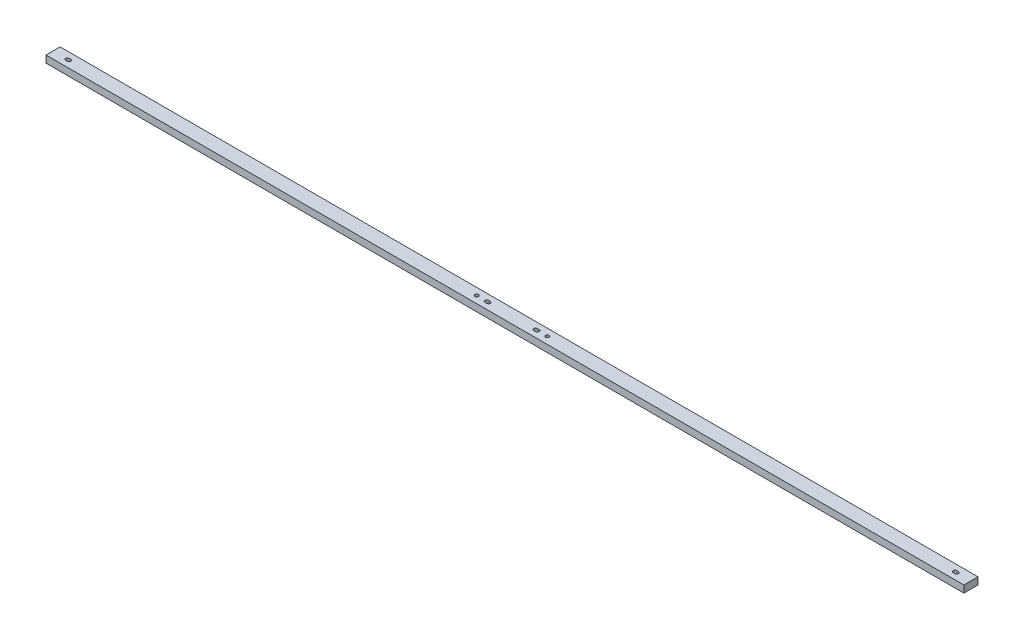
ISO-10303-21;
HEADER;
FILE_DESCRIPTION(('STEP AP214'),'2;1');
FILE_NAME('part.step','',(''),(''),'','','');
FILE_SCHEMA(('AUTOMOTIVE_DESIGN { 1 0 10303 214 1 1 1 1 }'));
ENDSEC;
DATA;
#1=APPLICATION_CONTEXT('core data for automotive mechanical design processes');
#2=APPLICATION_PROTOCOL_DEFINITION('international standard','automotive_design',2000,#1);
#3=PRODUCT_CONTEXT('',#1,'mechanical');
#4=PRODUCT('Part','Part','',(#3));
#5=PRODUCT_RELATED_PRODUCT_CATEGORY('part','',(#4));
#6=PRODUCT_DEFINITION_FORMATION('','',#4);
#7=PRODUCT_DEFINITION_CONTEXT('part definition',#1,'design');
#8=PRODUCT_DEFINITION('design','',#6,#7);
#9=PRODUCT_DEFINITION_SHAPE('','',#8);
#10=(LENGTH_UNIT() NAMED_UNIT(*) SI_UNIT(.MILLI.,.METRE.));
#11=(NAMED_UNIT(*) PLANE_ANGLE_UNIT() SI_UNIT($,.RADIAN.));
#12=(NAMED_UNIT(*) SI_UNIT($,.STERADIAN.) SOLID_ANGLE_UNIT());
#13=UNCERTAINTY_MEASURE_WITH_UNIT(LENGTH_MEASURE(1.E-05),#10,'distance_accuracy_value','');
#14=(GEOMETRIC_REPRESENTATION_CONTEXT(3) GLOBAL_UNCERTAINTY_ASSIGNED_CONTEXT((#13)) GLOBAL_UNIT_ASSIGNED_CONTEXT((#10,
#11,#12)) REPRESENTATION_CONTEXT('',''));
#15=CARTESIAN_POINT('',(0.,0.,0.));
#16=DIRECTION('',(0.,0.,1.));
#17=DIRECTION('',(1.,0.,0.));
#18=AXIS2_PLACEMENT_3D('',#15,#16,#17);
#19=CARTESIAN_POINT('',(0.,12.7,0.));
#20=DIRECTION('',(0.,1.,0.));
#21=DIRECTION('',(0.,0.,1.));
#22=AXIS2_PLACEMENT_3D('',#19,#20,#21);
#23=PLANE('',#22);
#24=CARTESIAN_POINT('',(63.5000000000007,12.7,0.));
#25=DIRECTION('',(0.,1.,0.));
#26=DIRECTION('',(0.,0.,1.));
#27=AXIS2_PLACEMENT_3D('',#24,#25,#26);
#28=CIRCLE('',#27,3.175);
#29=CARTESIAN_POINT('',(63.5000000000007,12.7,3.17500000000008));
#30=VERTEX_POINT('',#29);
#31=EDGE_CURVE('E209',#30,#30,#28,.T.);
#32=ORIENTED_EDGE('',*,*,#31,.F.);
#33=EDGE_LOOP('',(#32));
#34=FACE_BOUND('',#33,.T.);
#35=DIRECTION('',(0.,0.,-1.));
#36=VECTOR('',#35,1.);
#37=CARTESIAN_POINT('',(825.500000000001,12.7,-12.7));
#38=LINE('',#37,#36);
#39=CARTESIAN_POINT('',(825.500000000001,12.7,12.7));
#40=VERTEX_POINT('',#39);
#41=CARTESIAN_POINT('',(825.500000000001,12.7,-12.7));
#42=VERTEX_POINT('',#41);
#43=EDGE_CURVE('E312',#40,#42,#38,.T.);
#44=ORIENTED_EDGE('',*,*,#43,.T.);
#45=DIRECTION('',(-1.,0.,0.));
#46=VECTOR('',#45,1.);
#47=CARTESIAN_POINT('',(-825.499999999999,12.7,-12.7));
#48=LINE('',#47,#46);
#49=CARTESIAN_POINT('',(-825.499999999999,12.7,-12.7));
#50=VERTEX_POINT('',#49);
#51=EDGE_CURVE('E315',#42,#50,#48,.T.);
#52=ORIENTED_EDGE('',*,*,#51,.T.);
#53=DIRECTION('',(0.,0.,1.));
#54=VECTOR('',#53,1.);
#55=CARTESIAN_POINT('',(-825.499999999999,12.7,-12.7));
#56=LINE('',#55,#54);
#57=CARTESIAN_POINT('',(-825.499999999999,12.7,12.7));
#58=VERTEX_POINT('',#57);
#59=EDGE_CURVE('E318',#50,#58,#56,.T.);
#60=ORIENTED_EDGE('',*,*,#59,.T.);
#61=DIRECTION('',(1.,0.,0.));
#62=VECTOR('',#61,1.);
#63=CARTESIAN_POINT('',(-825.499999999999,12.7,12.7));
#64=LINE('',#63,#62);
#65=EDGE_CURVE('E320',#58,#40,#64,.T.);
#66=ORIENTED_EDGE('',*,*,#65,.T.);
#67=EDGE_LOOP('',(#44,#52,#60,#66));
#68=FACE_BOUND('',#67,.T.);
#69=DIRECTION('',(1.,0.,0.));
#70=VECTOR('',#69,1.);
#71=CARTESIAN_POINT('',(-799.655499999999,12.7,3.17500000000059));
#72=LINE('',#71,#70);
#73=CARTESIAN_POINT('',(-799.655499999999,12.7,3.17500000000059));
#74=VERTEX_POINT('',#73);
#75=CARTESIAN_POINT('',(-796.480499999999,12.7,3.17500000000039));
#76=VERTEX_POINT('',#75);
#77=EDGE_CURVE('E283',#74,#76,#72,.T.);
#78=ORIENTED_EDGE('',*,*,#77,.F.);
#79=CARTESIAN_POINT('',(-799.655499999999,12.7,0.));
#80=DIRECTION('',(0.,1.,0.));
#81=DIRECTION('',(0.,0.,1.));
#82=AXIS2_PLACEMENT_3D('',#79,#80,#81);
#83=CIRCLE('',#82,3.17500000000039);
#84=CARTESIAN_POINT('',(-799.655499999999,12.7,-3.1750000000002));
#85=VERTEX_POINT('',#84);
#86=EDGE_CURVE('E281',#85,#74,#83,.T.);
#87=ORIENTED_EDGE('',*,*,#86,.F.);
#88=DIRECTION('',(-1.,0.,0.));
#89=VECTOR('',#88,1.);
#90=CARTESIAN_POINT('',(-799.655499999999,12.7,-3.1750000000002));
#91=LINE('',#90,#89);
#92=CARTESIAN_POINT('',(-796.480499999999,12.7,-3.1750000000002));
#93=VERTEX_POINT('',#92);
#94=EDGE_CURVE('E289',#93,#85,#91,.T.);
#95=ORIENTED_EDGE('',*,*,#94,.F.);
#96=CARTESIAN_POINT('',(-796.480499999999,12.7,0.));
#97=DIRECTION('',(0.,1.,0.));
#98=DIRECTION('',(0.,0.,1.));
#99=AXIS2_PLACEMENT_3D('',#96,#97,#98);
#100=CIRCLE('',#99,3.17500000000039);
#101=EDGE_CURVE('E286',#76,#93,#100,.T.);
#102=ORIENTED_EDGE('',*,*,#101,.F.);
#103=EDGE_LOOP('',(#78,#87,#95,#102));
#104=FACE_BOUND('',#103,.T.);
#105=DIRECTION('',(-1.,0.,0.));
#106=VECTOR('',#105,1.);
#107=CARTESIAN_POINT('',(45.5295000000007,12.7,-3.17500000000001));
#108=LINE('',#107,#106);
#109=CARTESIAN_POINT('',(45.5295000000007,12.7,-3.17500000000001));
#110=VERTEX_POINT('',#109);
#111=CARTESIAN_POINT('',(42.3545000000007,12.7,-3.17500000000001));
#112=VERTEX_POINT('',#111);
#113=EDGE_CURVE('E252',#110,#112,#108,.T.);
#114=ORIENTED_EDGE('',*,*,#113,.F.);
#115=CARTESIAN_POINT('',(45.5295000000007,12.7,0.));
#116=DIRECTION('',(0.,1.,0.));
#117=DIRECTION('',(0.,0.,-1.));
#118=AXIS2_PLACEMENT_3D('',#115,#116,#117);
#119=CIRCLE('',#118,3.17500000000001);
#120=CARTESIAN_POINT('',(45.5295000000007,12.7,3.17500000000001));
#121=VERTEX_POINT('',#120);
#122=EDGE_CURVE('E250',#121,#110,#119,.T.);
#123=ORIENTED_EDGE('',*,*,#122,.F.);
#124=DIRECTION('',(1.,0.,0.));
#125=VECTOR('',#124,1.);
#126=CARTESIAN_POINT('',(45.5295000000007,12.7,3.17500000000001));
#127=LINE('',#126,#125);
#128=CARTESIAN_POINT('',(42.3545000000007,12.7,3.17500000000001));
#129=VERTEX_POINT('',#128);
#130=EDGE_CURVE('E258',#129,#121,#127,.T.);
#131=ORIENTED_EDGE('',*,*,#130,.F.);
#132=CARTESIAN_POINT('',(42.3545000000007,12.7,0.));
#133=DIRECTION('',(0.,1.,0.));
#134=DIRECTION('',(0.,0.,-1.));
#135=AXIS2_PLACEMENT_3D('',#132,#133,#134);
#136=CIRCLE('',#135,3.17500000000001);
#137=EDGE_CURVE('E255',#112,#129,#136,.T.);
#138=ORIENTED_EDGE('',*,*,#137,.F.);
#139=EDGE_LOOP('',(#114,#123,#131,#138));
#140=FACE_BOUND('',#139,.T.);
#141=DIRECTION('',(1.,0.,0.));
#142=VECTOR('',#141,1.);
#143=CARTESIAN_POINT('',(-45.5294999999993,12.7,3.17500000000002));
#144=LINE('',#143,#142);
#145=CARTESIAN_POINT('',(-45.5294999999993,12.7,3.17500000000002));
#146=VERTEX_POINT('',#145);
#147=CARTESIAN_POINT('',(-42.3544999999994,12.7,3.17500000000001));
#148=VERTEX_POINT('',#147);
#149=EDGE_CURVE('E221',#146,#148,#144,.T.);
#150=ORIENTED_EDGE('',*,*,#149,.F.);
#151=CARTESIAN_POINT('',(-45.5294999999993,12.7,0.));
#152=DIRECTION('',(0.,1.,0.));
#153=DIRECTION('',(0.,0.,1.));
#154=AXIS2_PLACEMENT_3D('',#151,#152,#153);
#155=CIRCLE('',#154,3.17500000000001);
#156=CARTESIAN_POINT('',(-45.5294999999993,12.7,-3.175));
#157=VERTEX_POINT('',#156);
#158=EDGE_CURVE('E219',#157,#146,#155,.T.);
#159=ORIENTED_EDGE('',*,*,#158,.F.);
#160=DIRECTION('',(-1.,0.,0.));
#161=VECTOR('',#160,1.);
#162=CARTESIAN_POINT('',(-45.5294999999993,12.7,-3.175));
#163=LINE('',#162,#161);
#164=CARTESIAN_POINT('',(-42.3544999999994,12.7,-3.175));
#165=VERTEX_POINT('',#164);
#166=EDGE_CURVE('E227',#165,#157,#163,.T.);
#167=ORIENTED_EDGE('',*,*,#166,.F.);
#168=CARTESIAN_POINT('',(-42.3544999999994,12.7,0.));
#169=DIRECTION('',(0.,1.,0.));
#170=DIRECTION('',(0.,0.,1.));
#171=AXIS2_PLACEMENT_3D('',#168,#169,#170);
#172=CIRCLE('',#171,3.17500000000001);
#173=EDGE_CURVE('E224',#148,#165,#172,.T.);
#174=ORIENTED_EDGE('',*,*,#173,.F.);
#175=EDGE_LOOP('',(#150,#159,#167,#174));
#176=FACE_BOUND('',#175,.T.);
#177=DIRECTION('',(-1.,0.,0.));
#178=VECTOR('',#177,1.);
#179=CARTESIAN_POINT('',(799.655500000001,12.7,-3.17500000000039));
#180=LINE('',#179,#178);
#181=CARTESIAN_POINT('',(799.655500000001,12.7,-3.17500000000039));
#182=VERTEX_POINT('',#181);
#183=CARTESIAN_POINT('',(796.480500000001,12.7,-3.17500000000039));
#184=VERTEX_POINT('',#183);
#185=EDGE_CURVE('E188',#182,#184,#180,.T.);
#186=ORIENTED_EDGE('',*,*,#185,.F.);
#187=CARTESIAN_POINT('',(799.655500000001,12.7,-1.95859109699115E-13));
#188=DIRECTION('',(0.,1.,0.));
#189=DIRECTION('',(0.,0.,-1.));
#190=AXIS2_PLACEMENT_3D('',#187,#188,#189);
#191=CIRCLE('',#190,3.17500000000039);
#192=CARTESIAN_POINT('',(799.655500000001,12.7,3.17500000000039));
#193=VERTEX_POINT('',#192);
#194=EDGE_CURVE('E180',#193,#182,#191,.T.);
#195=ORIENTED_EDGE('',*,*,#194,.F.);
#196=DIRECTION('',(1.,0.,0.));
#197=VECTOR('',#196,1.);
#198=CARTESIAN_POINT('',(799.655500000001,12.7,3.17500000000039));
#199=LINE('',#198,#197);
#200=CARTESIAN_POINT('',(796.480500000001,12.7,3.17500000000039));
#201=VERTEX_POINT('',#200);
#202=EDGE_CURVE('E203',#201,#193,#199,.T.);
#203=ORIENTED_EDGE('',*,*,#202,.F.);
#204=CARTESIAN_POINT('',(796.480500000001,12.7,-1.95664697019751E-13));
#205=DIRECTION('',(0.,1.,0.));
#206=DIRECTION('',(0.,0.,-1.));
#207=AXIS2_PLACEMENT_3D('',#204,#205,#206);
#208=CIRCLE('',#207,3.17500000000039);
#209=EDGE_CURVE('E201',#184,#201,#208,.T.);
#210=ORIENTED_EDGE('',*,*,#209,.F.);
#211=EDGE_LOOP('',(#186,#195,#203,#210));
#212=FACE_BOUND('',#211,.T.);
#213=CARTESIAN_POINT('',(-63.4999999999996,12.7,0.));
#214=DIRECTION('',(0.,1.,0.));
#215=DIRECTION('',(0.,0.,-1.));
#216=AXIS2_PLACEMENT_3D('',#213,#214,#215);
#217=CIRCLE('',#216,3.175);
#218=CARTESIAN_POINT('',(-63.4999999999996,12.7,-3.17499999999991));
#219=VERTEX_POINT('',#218);
#220=EDGE_CURVE('E562',#219,#219,#217,.T.);
#221=ORIENTED_EDGE('',*,*,#220,.F.);
#222=EDGE_LOOP('',(#221));
#223=FACE_BOUND('',#222,.T.);
#224=ADVANCED_FACE('F43',(#34,#68,#104,#140,#176,#212,#223),#23,.T.);
#225=CARTESIAN_POINT('',(0.,0.,0.));
#226=DIRECTION('',(0.,1.,0.));
#227=DIRECTION('',(0.,0.,1.));
#228=AXIS2_PLACEMENT_3D('',#225,#226,#227);
#229=PLANE('',#228);
#230=CARTESIAN_POINT('',(-45.5294999999993,0.,0.));
#231=DIRECTION('',(0.,1.,0.));
#232=DIRECTION('',(0.,0.,1.));
#233=AXIS2_PLACEMENT_3D('',#230,#231,#232);
#234=CIRCLE('',#233,3.17500000000001);
#235=CARTESIAN_POINT('',(-45.5294999999993,0.,-3.175));
#236=VERTEX_POINT('',#235);
#237=CARTESIAN_POINT('',(-45.5294999999993,0.,3.17500000000002));
#238=VERTEX_POINT('',#237);
#239=EDGE_CURVE('E196',#236,#238,#234,.T.);
#240=ORIENTED_EDGE('',*,*,#239,.T.);
#241=DIRECTION('',(1.,0.,0.));
#242=VECTOR('',#241,1.);
#243=CARTESIAN_POINT('',(-45.5294999999993,0.,3.17500000000002));
#244=LINE('',#243,#242);
#245=CARTESIAN_POINT('',(-42.3544999999994,0.,3.17500000000001));
#246=VERTEX_POINT('',#245);
#247=EDGE_CURVE('E232',#238,#246,#244,.T.);
#248=ORIENTED_EDGE('',*,*,#247,.T.);
#249=CARTESIAN_POINT('',(-42.3544999999994,0.,0.));
#250=DIRECTION('',(0.,1.,0.));
#251=DIRECTION('',(0.,0.,1.));
#252=AXIS2_PLACEMENT_3D('',#249,#250,#251);
#253=CIRCLE('',#252,3.17500000000001);
#254=CARTESIAN_POINT('',(-42.3544999999994,0.,-3.175));
#255=VERTEX_POINT('',#254);
#256=EDGE_CURVE('E235',#246,#255,#253,.T.);
#257=ORIENTED_EDGE('',*,*,#256,.T.);
#258=DIRECTION('',(-1.,0.,0.));
#259=VECTOR('',#258,1.);
#260=CARTESIAN_POINT('',(-45.5294999999993,0.,-3.175));
#261=LINE('',#260,#259);
#262=EDGE_CURVE('E222',#255,#236,#261,.T.);
#263=ORIENTED_EDGE('',*,*,#262,.T.);
#264=EDGE_LOOP('',(#240,#248,#257,#263));
#265=FACE_BOUND('',#264,.T.);
#266=CARTESIAN_POINT('',(-799.655499999999,0.,0.));
#267=DIRECTION('',(0.,1.,0.));
#268=DIRECTION('',(0.,0.,1.));
#269=AXIS2_PLACEMENT_3D('',#266,#267,#268);
#270=CIRCLE('',#269,3.17500000000039);
#271=CARTESIAN_POINT('',(-799.655499999999,0.,-3.1750000000002));
#272=VERTEX_POINT('',#271);
#273=CARTESIAN_POINT('',(-799.655499999999,0.,3.17500000000059));
#274=VERTEX_POINT('',#273);
#275=EDGE_CURVE('E280',#272,#274,#270,.T.);
#276=ORIENTED_EDGE('',*,*,#275,.T.);
#277=DIRECTION('',(1.,0.,0.));
#278=VECTOR('',#277,1.);
#279=CARTESIAN_POINT('',(-799.655499999999,0.,3.17500000000059));
#280=LINE('',#279,#278);
#281=CARTESIAN_POINT('',(-796.480499999999,0.,3.17500000000039));
#282=VERTEX_POINT('',#281);
#283=EDGE_CURVE('E294',#274,#282,#280,.T.);
#284=ORIENTED_EDGE('',*,*,#283,.T.);
#285=CARTESIAN_POINT('',(-796.480499999999,0.,0.));
#286=DIRECTION('',(0.,1.,0.));
#287=DIRECTION('',(0.,0.,1.));
#288=AXIS2_PLACEMENT_3D('',#285,#286,#287);
#289=CIRCLE('',#288,3.17500000000039);
#290=CARTESIAN_POINT('',(-796.480499999999,0.,-3.1750000000002));
#291=VERTEX_POINT('',#290);
#292=EDGE_CURVE('E297',#282,#291,#289,.T.);
#293=ORIENTED_EDGE('',*,*,#292,.T.);
#294=DIRECTION('',(-1.,0.,0.));
#295=VECTOR('',#294,1.);
#296=CARTESIAN_POINT('',(-799.655499999999,0.,-3.1750000000002));
#297=LINE('',#296,#295);
#298=EDGE_CURVE('E284',#291,#272,#297,.T.);
#299=ORIENTED_EDGE('',*,*,#298,.T.);
#300=EDGE_LOOP('',(#276,#284,#293,#299));
#301=FACE_BOUND('',#300,.T.);
#302=DIRECTION('',(0.,0.,-1.));
#303=VECTOR('',#302,1.);
#304=CARTESIAN_POINT('',(825.500000000001,0.,-12.7));
#305=LINE('',#304,#303);
#306=CARTESIAN_POINT('',(825.500000000001,0.,12.7));
#307=VERTEX_POINT('',#306);
#308=CARTESIAN_POINT('',(825.500000000001,0.,-12.7));
#309=VERTEX_POINT('',#308);
#310=EDGE_CURVE('E311',#307,#309,#305,.T.);
#311=ORIENTED_EDGE('',*,*,#310,.F.);
#312=DIRECTION('',(1.,0.,0.));
#313=VECTOR('',#312,1.);
#314=CARTESIAN_POINT('',(-825.499999999999,0.,12.7));
#315=LINE('',#314,#313);
#316=CARTESIAN_POINT('',(-825.499999999999,0.,12.7));
#317=VERTEX_POINT('',#316);
#318=EDGE_CURVE('E316',#317,#307,#315,.T.);
#319=ORIENTED_EDGE('',*,*,#318,.F.);
#320=DIRECTION('',(0.,0.,1.));
#321=VECTOR('',#320,1.);
#322=CARTESIAN_POINT('',(-825.499999999999,0.,-12.7));
#323=LINE('',#322,#321);
#324=CARTESIAN_POINT('',(-825.499999999999,0.,-12.7));
#325=VERTEX_POINT('',#324);
#326=EDGE_CURVE('E327',#325,#317,#323,.T.);
#327=ORIENTED_EDGE('',*,*,#326,.F.);
#328=DIRECTION('',(-1.,0.,0.));
#329=VECTOR('',#328,1.);
#330=CARTESIAN_POINT('',(-825.499999999999,0.,-12.7));
#331=LINE('',#330,#329);
#332=EDGE_CURVE('E325',#309,#325,#331,.T.);
#333=ORIENTED_EDGE('',*,*,#332,.F.);
#334=EDGE_LOOP('',(#311,#319,#327,#333));
#335=FACE_BOUND('',#334,.T.);
#336=CARTESIAN_POINT('',(45.5295000000007,0.,0.));
#337=DIRECTION('',(0.,1.,0.));
#338=DIRECTION('',(0.,0.,-1.));
#339=AXIS2_PLACEMENT_3D('',#336,#337,#338);
#340=CIRCLE('',#339,3.17500000000001);
#341=CARTESIAN_POINT('',(45.5295000000007,0.,3.17500000000001));
#342=VERTEX_POINT('',#341);
#343=CARTESIAN_POINT('',(45.5295000000007,0.,-3.17500000000001));
#344=VERTEX_POINT('',#343);
#345=EDGE_CURVE('E249',#342,#344,#340,.T.);
#346=ORIENTED_EDGE('',*,*,#345,.T.);
#347=DIRECTION('',(-1.,0.,0.));
#348=VECTOR('',#347,1.);
#349=CARTESIAN_POINT('',(45.5295000000007,0.,-3.17500000000001));
#350=LINE('',#349,#348);
#351=CARTESIAN_POINT('',(42.3545000000007,0.,-3.17500000000001));
#352=VERTEX_POINT('',#351);
#353=EDGE_CURVE('E263',#344,#352,#350,.T.);
#354=ORIENTED_EDGE('',*,*,#353,.T.);
#355=CARTESIAN_POINT('',(42.3545000000007,0.,0.));
#356=DIRECTION('',(0.,1.,0.));
#357=DIRECTION('',(0.,0.,-1.));
#358=AXIS2_PLACEMENT_3D('',#355,#356,#357);
#359=CIRCLE('',#358,3.17500000000001);
#360=CARTESIAN_POINT('',(42.3545000000007,0.,3.175));
#361=VERTEX_POINT('',#360);
#362=EDGE_CURVE('E266',#352,#361,#359,.T.);
#363=ORIENTED_EDGE('',*,*,#362,.T.);
#364=DIRECTION('',(1.,0.,0.));
#365=VECTOR('',#364,1.);
#366=CARTESIAN_POINT('',(45.5295000000007,0.,3.17500000000001));
#367=LINE('',#366,#365);
#368=EDGE_CURVE('E253',#361,#342,#367,.T.);
#369=ORIENTED_EDGE('',*,*,#368,.T.);
#370=EDGE_LOOP('',(#346,#354,#363,#369));
#371=FACE_BOUND('',#370,.T.);
#372=CARTESIAN_POINT('',(799.655500000001,0.,-1.95859109699115E-13));
#373=DIRECTION('',(0.,1.,0.));
#374=DIRECTION('',(0.,0.,-1.));
#375=AXIS2_PLACEMENT_3D('',#372,#373,#374);
#376=CIRCLE('',#375,3.17500000000039);
#377=CARTESIAN_POINT('',(799.655500000001,0.,3.17500000000039));
#378=VERTEX_POINT('',#377);
#379=CARTESIAN_POINT('',(799.655500000001,0.,-3.17500000000039));
#380=VERTEX_POINT('',#379);
#381=EDGE_CURVE('E66',#378,#380,#376,.T.);
#382=ORIENTED_EDGE('',*,*,#381,.T.);
#383=DIRECTION('',(-1.,0.,0.));
#384=VECTOR('',#383,1.);
#385=CARTESIAN_POINT('',(799.655500000001,0.,-3.17500000000039));
#386=LINE('',#385,#384);
#387=CARTESIAN_POINT('',(796.480500000001,0.,-3.17500000000039));
#388=VERTEX_POINT('',#387);
#389=EDGE_CURVE('E195',#380,#388,#386,.T.);
#390=ORIENTED_EDGE('',*,*,#389,.T.);
#391=CARTESIAN_POINT('',(796.480500000001,0.,-1.95664697019751E-13));
#392=DIRECTION('',(0.,1.,0.));
#393=DIRECTION('',(0.,0.,-1.));
#394=AXIS2_PLACEMENT_3D('',#391,#392,#393);
#395=CIRCLE('',#394,3.17500000000039);
#396=CARTESIAN_POINT('',(796.480500000001,0.,3.1750000000002));
#397=VERTEX_POINT('',#396);
#398=EDGE_CURVE('E211',#388,#397,#395,.T.);
#399=ORIENTED_EDGE('',*,*,#398,.T.);
#400=DIRECTION('',(1.,0.,0.));
#401=VECTOR('',#400,1.);
#402=CARTESIAN_POINT('',(799.655500000001,0.,3.17500000000039));
#403=LINE('',#402,#401);
#404=EDGE_CURVE('E189',#397,#378,#403,.T.);
#405=ORIENTED_EDGE('',*,*,#404,.T.);
#406=EDGE_LOOP('',(#382,#390,#399,#405));
#407=FACE_BOUND('',#406,.T.);
#408=CARTESIAN_POINT('',(63.5000000000007,0.,0.));
#409=DIRECTION('',(0.,1.,0.));
#410=DIRECTION('',(0.,0.,1.));
#411=AXIS2_PLACEMENT_3D('',#408,#409,#410);
#412=CIRCLE('',#411,3.175);
#413=CARTESIAN_POINT('',(63.5000000000007,0.,3.17500000000008));
#414=VERTEX_POINT('',#413);
#415=EDGE_CURVE('E568',#414,#414,#412,.T.);
#416=ORIENTED_EDGE('',*,*,#415,.T.);
#417=EDGE_LOOP('',(#416));
#418=FACE_BOUND('',#417,.T.);
#419=CARTESIAN_POINT('',(-63.4999999999996,0.,0.));
#420=DIRECTION('',(0.,1.,0.));
#421=DIRECTION('',(0.,0.,-1.));
#422=AXIS2_PLACEMENT_3D('',#419,#420,#421);
#423=CIRCLE('',#422,3.175);
#424=CARTESIAN_POINT('',(-63.4999999999996,0.,-3.17499999999991));
#425=VERTEX_POINT('',#424);
#426=EDGE_CURVE('E565',#425,#425,#423,.T.);
#427=ORIENTED_EDGE('',*,*,#426,.T.);
#428=EDGE_LOOP('',(#427));
#429=FACE_BOUND('',#428,.T.);
#430=ADVANCED_FACE('F345',(#265,#301,#335,#371,#407,#418,#429),#229,.F.);
#431=CARTESIAN_POINT('',(825.500000000001,12.7,-12.7));
#432=DIRECTION('',(-1.,0.,0.));
#433=DIRECTION('',(0.,0.,1.));
#434=AXIS2_PLACEMENT_3D('',#431,#432,#433);
#435=PLANE('',#434);
#436=ORIENTED_EDGE('',*,*,#310,.T.);
#437=DIRECTION('',(0.,-1.,0.));
#438=VECTOR('',#437,1.);
#439=CARTESIAN_POINT('',(825.500000000001,12.7,-12.7));
#440=LINE('',#439,#438);
#441=EDGE_CURVE('E11',#42,#309,#440,.T.);
#442=ORIENTED_EDGE('',*,*,#441,.F.);
#443=ORIENTED_EDGE('',*,*,#43,.F.);
#444=DIRECTION('',(0.,-1.,0.));
#445=VECTOR('',#444,1.);
#446=CARTESIAN_POINT('',(825.500000000001,12.7,12.7));
#447=LINE('',#446,#445);
#448=EDGE_CURVE('E322',#40,#307,#447,.T.);
#449=ORIENTED_EDGE('',*,*,#448,.T.);
#450=EDGE_LOOP('',(#436,#442,#443,#449));
#451=FACE_BOUND('',#450,.T.);
#452=ADVANCED_FACE('F45',(#451),#435,.F.);
#453=CARTESIAN_POINT('',(-825.499999999999,12.7,-12.7));
#454=DIRECTION('',(0.,0.,1.));
#455=DIRECTION('',(1.,0.,0.));
#456=AXIS2_PLACEMENT_3D('',#453,#454,#455);
#457=PLANE('',#456);
#458=ORIENTED_EDGE('',*,*,#332,.T.);
#459=DIRECTION('',(0.,-1.,0.));
#460=VECTOR('',#459,1.);
#461=CARTESIAN_POINT('',(-825.499999999999,12.7,-12.7));
#462=LINE('',#461,#460);
#463=EDGE_CURVE('E51',#50,#325,#462,.T.);
#464=ORIENTED_EDGE('',*,*,#463,.F.);
#465=ORIENTED_EDGE('',*,*,#51,.F.);
#466=ORIENTED_EDGE('',*,*,#441,.T.);
#467=EDGE_LOOP('',(#458,#464,#465,#466));
#468=FACE_BOUND('',#467,.T.);
#469=ADVANCED_FACE('F356',(#468),#457,.F.);
#470=CARTESIAN_POINT('',(-825.499999999999,12.7,-12.7));
#471=DIRECTION('',(1.,0.,0.));
#472=DIRECTION('',(0.,0.,-1.));
#473=AXIS2_PLACEMENT_3D('',#470,#471,#472);
#474=PLANE('',#473);
#475=ORIENTED_EDGE('',*,*,#326,.T.);
#476=DIRECTION('',(0.,-1.,0.));
#477=VECTOR('',#476,1.);
#478=CARTESIAN_POINT('',(-825.499999999999,12.7,12.7));
#479=LINE('',#478,#477);
#480=EDGE_CURVE('E332',#58,#317,#479,.T.);
#481=ORIENTED_EDGE('',*,*,#480,.F.);
#482=ORIENTED_EDGE('',*,*,#59,.F.);
#483=ORIENTED_EDGE('',*,*,#463,.T.);
#484=EDGE_LOOP('',(#475,#481,#482,#483));
#485=FACE_BOUND('',#484,.T.);
#486=ADVANCED_FACE('F339',(#485),#474,.F.);
#487=CARTESIAN_POINT('',(-825.499999999999,12.7,12.7));
#488=DIRECTION('',(0.,0.,-1.));
#489=DIRECTION('',(-1.,0.,0.));
#490=AXIS2_PLACEMENT_3D('',#487,#488,#489);
#491=PLANE('',#490);
#492=ORIENTED_EDGE('',*,*,#318,.T.);
#493=ORIENTED_EDGE('',*,*,#448,.F.);
#494=ORIENTED_EDGE('',*,*,#65,.F.);
#495=ORIENTED_EDGE('',*,*,#480,.T.);
#496=EDGE_LOOP('',(#492,#493,#494,#495));
#497=FACE_BOUND('',#496,.T.);
#498=ADVANCED_FACE('F349',(#497),#491,.F.);
#499=CARTESIAN_POINT('',(-799.655499999999,12.7,0.));
#500=DIRECTION('',(0.,-1.,0.));
#501=DIRECTION('',(0.,0.,-1.));
#502=AXIS2_PLACEMENT_3D('',#499,#500,#501);
#503=CYLINDRICAL_SURFACE('',#502,3.17500000000039);
#504=ORIENTED_EDGE('',*,*,#275,.F.);
#505=DIRECTION('',(0.,-1.,0.));
#506=VECTOR('',#505,1.);
#507=CARTESIAN_POINT('',(-799.655499999999,12.7,-3.1750000000002));
#508=LINE('',#507,#506);
#509=EDGE_CURVE('E291',#85,#272,#508,.T.);
#510=ORIENTED_EDGE('',*,*,#509,.F.);
#511=ORIENTED_EDGE('',*,*,#86,.T.);
#512=DIRECTION('',(0.,-1.,0.));
#513=VECTOR('',#512,1.);
#514=CARTESIAN_POINT('',(-799.655499999999,12.7,3.17500000000059));
#515=LINE('',#514,#513);
#516=EDGE_CURVE('E308',#74,#274,#515,.T.);
#517=ORIENTED_EDGE('',*,*,#516,.T.);
#518=EDGE_LOOP('',(#504,#510,#511,#517));
#519=FACE_BOUND('',#518,.T.);
#520=ADVANCED_FACE('F373',(#519),#503,.F.);
#521=CARTESIAN_POINT('',(-799.655499999999,12.7,3.17500000000059));
#522=DIRECTION('',(0.,0.,-1.));
#523=DIRECTION('',(-1.,0.,0.));
#524=AXIS2_PLACEMENT_3D('',#521,#522,#523);
#525=PLANE('',#524);
#526=ORIENTED_EDGE('',*,*,#283,.F.);
#527=ORIENTED_EDGE('',*,*,#516,.F.);
#528=ORIENTED_EDGE('',*,*,#77,.T.);
#529=DIRECTION('',(0.,-1.,0.));
#530=VECTOR('',#529,1.);
#531=CARTESIAN_POINT('',(-796.480499999999,12.7,3.17500000000039));
#532=LINE('',#531,#530);
#533=EDGE_CURVE('E306',#76,#282,#532,.T.);
#534=ORIENTED_EDGE('',*,*,#533,.T.);
#535=EDGE_LOOP('',(#526,#527,#528,#534));
#536=FACE_BOUND('',#535,.T.);
#537=ADVANCED_FACE('F380',(#536),#525,.T.);
#538=CARTESIAN_POINT('',(-796.480499999999,12.7,0.));
#539=DIRECTION('',(0.,-1.,0.));
#540=DIRECTION('',(0.,0.,-1.));
#541=AXIS2_PLACEMENT_3D('',#538,#539,#540);
#542=CYLINDRICAL_SURFACE('',#541,3.17500000000039);
#543=ORIENTED_EDGE('',*,*,#292,.F.);
#544=ORIENTED_EDGE('',*,*,#533,.F.);
#545=ORIENTED_EDGE('',*,*,#101,.T.);
#546=DIRECTION('',(0.,-1.,0.));
#547=VECTOR('',#546,1.);
#548=CARTESIAN_POINT('',(-796.480499999999,12.7,-3.1750000000002));
#549=LINE('',#548,#547);
#550=EDGE_CURVE('E304',#93,#291,#549,.T.);
#551=ORIENTED_EDGE('',*,*,#550,.T.);
#552=EDGE_LOOP('',(#543,#544,#545,#551));
#553=FACE_BOUND('',#552,.T.);
#554=ADVANCED_FACE('F385',(#553),#542,.F.);
#555=CARTESIAN_POINT('',(-799.655499999999,12.7,-3.1750000000002));
#556=DIRECTION('',(0.,0.,1.));
#557=DIRECTION('',(1.,0.,0.));
#558=AXIS2_PLACEMENT_3D('',#555,#556,#557);
#559=PLANE('',#558);
#560=ORIENTED_EDGE('',*,*,#298,.F.);
#561=ORIENTED_EDGE('',*,*,#550,.F.);
#562=ORIENTED_EDGE('',*,*,#94,.T.);
#563=ORIENTED_EDGE('',*,*,#509,.T.);
#564=EDGE_LOOP('',(#560,#561,#562,#563));
#565=FACE_BOUND('',#564,.T.);
#566=ADVANCED_FACE('F393',(#565),#559,.T.);
#567=CARTESIAN_POINT('',(45.5295000000007,12.7,0.));
#568=DIRECTION('',(0.,-1.,0.));
#569=DIRECTION('',(0.,0.,-1.));
#570=AXIS2_PLACEMENT_3D('',#567,#568,#569);
#571=CYLINDRICAL_SURFACE('',#570,3.17500000000001);
#572=ORIENTED_EDGE('',*,*,#345,.F.);
#573=DIRECTION('',(0.,-1.,0.));
#574=VECTOR('',#573,1.);
#575=CARTESIAN_POINT('',(45.5295000000007,12.7,3.17500000000001));
#576=LINE('',#575,#574);
#577=EDGE_CURVE('E260',#121,#342,#576,.T.);
#578=ORIENTED_EDGE('',*,*,#577,.F.);
#579=ORIENTED_EDGE('',*,*,#122,.T.);
#580=DIRECTION('',(0.,-1.,0.));
#581=VECTOR('',#580,1.);
#582=CARTESIAN_POINT('',(45.5295000000007,12.7,-3.17500000000001));
#583=LINE('',#582,#581);
#584=EDGE_CURVE('E277',#110,#344,#583,.T.);
#585=ORIENTED_EDGE('',*,*,#584,.T.);
#586=EDGE_LOOP('',(#572,#578,#579,#585));
#587=FACE_BOUND('',#586,.T.);
#588=ADVANCED_FACE('F447',(#587),#571,.F.);
#589=CARTESIAN_POINT('',(45.5295000000007,12.7,-3.17500000000001));
#590=DIRECTION('',(0.,0.,1.));
#591=DIRECTION('',(1.,0.,0.));
#592=AXIS2_PLACEMENT_3D('',#589,#590,#591);
#593=PLANE('',#592);
#594=ORIENTED_EDGE('',*,*,#353,.F.);
#595=ORIENTED_EDGE('',*,*,#584,.F.);
#596=ORIENTED_EDGE('',*,*,#113,.T.);
#597=DIRECTION('',(0.,-1.,0.));
#598=VECTOR('',#597,1.);
#599=CARTESIAN_POINT('',(42.3545000000007,12.7,-3.17500000000001));
#600=LINE('',#599,#598);
#601=EDGE_CURVE('E275',#112,#352,#600,.T.);
#602=ORIENTED_EDGE('',*,*,#601,.T.);
#603=EDGE_LOOP('',(#594,#595,#596,#602));
#604=FACE_BOUND('',#603,.T.);
#605=ADVANCED_FACE('F443',(#604),#593,.T.);
#606=CARTESIAN_POINT('',(42.3545000000007,12.7,0.));
#607=DIRECTION('',(0.,-1.,0.));
#608=DIRECTION('',(0.,0.,-1.));
#609=AXIS2_PLACEMENT_3D('',#606,#607,#608);
#610=CYLINDRICAL_SURFACE('',#609,3.17500000000001);
#611=ORIENTED_EDGE('',*,*,#362,.F.);
#612=ORIENTED_EDGE('',*,*,#601,.F.);
#613=ORIENTED_EDGE('',*,*,#137,.T.);
#614=DIRECTION('',(0.,-1.,0.));
#615=VECTOR('',#614,1.);
#616=CARTESIAN_POINT('',(42.3545000000007,12.7,3.175));
#617=LINE('',#616,#615);
#618=EDGE_CURVE('E273',#129,#361,#617,.T.);
#619=ORIENTED_EDGE('',*,*,#618,.T.);
#620=EDGE_LOOP('',(#611,#612,#613,#619));
#621=FACE_BOUND('',#620,.T.);
#622=ADVANCED_FACE('F439',(#621),#610,.F.);
#623=CARTESIAN_POINT('',(45.5295000000007,12.7,3.17500000000001));
#624=DIRECTION('',(0.,0.,-1.));
#625=DIRECTION('',(-1.,0.,0.));
#626=AXIS2_PLACEMENT_3D('',#623,#624,#625);
#627=PLANE('',#626);
#628=ORIENTED_EDGE('',*,*,#368,.F.);
#629=ORIENTED_EDGE('',*,*,#618,.F.);
#630=ORIENTED_EDGE('',*,*,#130,.T.);
#631=ORIENTED_EDGE('',*,*,#577,.T.);
#632=EDGE_LOOP('',(#628,#629,#630,#631));
#633=FACE_BOUND('',#632,.T.);
#634=ADVANCED_FACE('F436',(#633),#627,.T.);
#635=CARTESIAN_POINT('',(-45.5294999999993,12.7,0.));
#636=DIRECTION('',(0.,-1.,0.));
#637=DIRECTION('',(0.,0.,-1.));
#638=AXIS2_PLACEMENT_3D('',#635,#636,#637);
#639=CYLINDRICAL_SURFACE('',#638,3.17500000000001);
#640=ORIENTED_EDGE('',*,*,#239,.F.);
#641=DIRECTION('',(0.,-1.,0.));
#642=VECTOR('',#641,1.);
#643=CARTESIAN_POINT('',(-45.5294999999993,12.7,-3.175));
#644=LINE('',#643,#642);
#645=EDGE_CURVE('E229',#157,#236,#644,.T.);
#646=ORIENTED_EDGE('',*,*,#645,.F.);
#647=ORIENTED_EDGE('',*,*,#158,.T.);
#648=DIRECTION('',(0.,-1.,0.));
#649=VECTOR('',#648,1.);
#650=CARTESIAN_POINT('',(-45.5294999999993,12.7,3.17500000000002));
#651=LINE('',#650,#649);
#652=EDGE_CURVE('E246',#146,#238,#651,.T.);
#653=ORIENTED_EDGE('',*,*,#652,.T.);
#654=EDGE_LOOP('',(#640,#646,#647,#653));
#655=FACE_BOUND('',#654,.T.);
#656=ADVANCED_FACE('F418',(#655),#639,.F.);
#657=CARTESIAN_POINT('',(-45.5294999999993,12.7,3.17500000000002));
#658=DIRECTION('',(0.,0.,-1.));
#659=DIRECTION('',(-1.,0.,0.));
#660=AXIS2_PLACEMENT_3D('',#657,#658,#659);
#661=PLANE('',#660);
#662=ORIENTED_EDGE('',*,*,#247,.F.);
#663=ORIENTED_EDGE('',*,*,#652,.F.);
#664=ORIENTED_EDGE('',*,*,#149,.T.);
#665=DIRECTION('',(0.,-1.,0.));
#666=VECTOR('',#665,1.);
#667=CARTESIAN_POINT('',(-42.3544999999994,12.7,3.17500000000001));
#668=LINE('',#667,#666);
#669=EDGE_CURVE('E244',#148,#246,#668,.T.);
#670=ORIENTED_EDGE('',*,*,#669,.T.);
#671=EDGE_LOOP('',(#662,#663,#664,#670));
#672=FACE_BOUND('',#671,.T.);
#673=ADVANCED_FACE('F412',(#672),#661,.T.);
#674=CARTESIAN_POINT('',(-42.3544999999994,12.7,0.));
#675=DIRECTION('',(0.,-1.,0.));
#676=DIRECTION('',(0.,0.,-1.));
#677=AXIS2_PLACEMENT_3D('',#674,#675,#676);
#678=CYLINDRICAL_SURFACE('',#677,3.17500000000001);
#679=ORIENTED_EDGE('',*,*,#256,.F.);
#680=ORIENTED_EDGE('',*,*,#669,.F.);
#681=ORIENTED_EDGE('',*,*,#173,.T.);
#682=DIRECTION('',(0.,-1.,0.));
#683=VECTOR('',#682,1.);
#684=CARTESIAN_POINT('',(-42.3544999999994,12.7,-3.175));
#685=LINE('',#684,#683);
#686=EDGE_CURVE('E242',#165,#255,#685,.T.);
#687=ORIENTED_EDGE('',*,*,#686,.T.);
#688=EDGE_LOOP('',(#679,#680,#681,#687));
#689=FACE_BOUND('',#688,.T.);
#690=ADVANCED_FACE('F415',(#689),#678,.F.);
#691=CARTESIAN_POINT('',(-45.5294999999993,12.7,-3.175));
#692=DIRECTION('',(0.,0.,1.));
#693=DIRECTION('',(1.,0.,0.));
#694=AXIS2_PLACEMENT_3D('',#691,#692,#693);
#695=PLANE('',#694);
#696=ORIENTED_EDGE('',*,*,#262,.F.);
#697=ORIENTED_EDGE('',*,*,#686,.F.);
#698=ORIENTED_EDGE('',*,*,#166,.T.);
#699=ORIENTED_EDGE('',*,*,#645,.T.);
#700=EDGE_LOOP('',(#696,#697,#698,#699));
#701=FACE_BOUND('',#700,.T.);
#702=ADVANCED_FACE('F421',(#701),#695,.T.);
#703=CARTESIAN_POINT('',(799.655500000001,12.7,-1.95859109699115E-13));
#704=DIRECTION('',(0.,-1.,0.));
#705=DIRECTION('',(0.,0.,-1.));
#706=AXIS2_PLACEMENT_3D('',#703,#704,#705);
#707=CYLINDRICAL_SURFACE('',#706,3.17500000000039);
#708=ORIENTED_EDGE('',*,*,#381,.F.);
#709=DIRECTION('',(0.,-1.,0.));
#710=VECTOR('',#709,1.);
#711=CARTESIAN_POINT('',(799.655500000001,12.7,3.17500000000039));
#712=LINE('',#711,#710);
#713=EDGE_CURVE('E184',#193,#378,#712,.T.);
#714=ORIENTED_EDGE('',*,*,#713,.F.);
#715=ORIENTED_EDGE('',*,*,#194,.T.);
#716=DIRECTION('',(0.,-1.,0.));
#717=VECTOR('',#716,1.);
#718=CARTESIAN_POINT('',(799.655500000001,12.7,-3.17500000000039));
#719=LINE('',#718,#717);
#720=EDGE_CURVE('E183',#182,#380,#719,.T.);
#721=ORIENTED_EDGE('',*,*,#720,.T.);
#722=EDGE_LOOP('',(#708,#714,#715,#721));
#723=FACE_BOUND('',#722,.T.);
#724=ADVANCED_FACE('F182',(#723),#707,.F.);
#725=CARTESIAN_POINT('',(799.655500000001,12.7,-3.17500000000039));
#726=DIRECTION('',(0.,0.,1.));
#727=DIRECTION('',(1.,0.,0.));
#728=AXIS2_PLACEMENT_3D('',#725,#726,#727);
#729=PLANE('',#728);
#730=ORIENTED_EDGE('',*,*,#389,.F.);
#731=ORIENTED_EDGE('',*,*,#720,.F.);
#732=ORIENTED_EDGE('',*,*,#185,.T.);
#733=DIRECTION('',(0.,-1.,0.));
#734=VECTOR('',#733,1.);
#735=CARTESIAN_POINT('',(796.480500000001,12.7,-3.17500000000039));
#736=LINE('',#735,#734);
#737=EDGE_CURVE('E197',#184,#388,#736,.T.);
#738=ORIENTED_EDGE('',*,*,#737,.T.);
#739=EDGE_LOOP('',(#730,#731,#732,#738));
#740=FACE_BOUND('',#739,.T.);
#741=ADVANCED_FACE('F192',(#740),#729,.T.);
#742=CARTESIAN_POINT('',(796.480500000001,12.7,-1.95664697019751E-13));
#743=DIRECTION('',(0.,-1.,0.));
#744=DIRECTION('',(0.,0.,-1.));
#745=AXIS2_PLACEMENT_3D('',#742,#743,#744);
#746=CYLINDRICAL_SURFACE('',#745,3.17500000000039);
#747=ORIENTED_EDGE('',*,*,#398,.F.);
#748=ORIENTED_EDGE('',*,*,#737,.F.);
#749=ORIENTED_EDGE('',*,*,#209,.T.);
#750=DIRECTION('',(0.,-1.,0.));
#751=VECTOR('',#750,1.);
#752=CARTESIAN_POINT('',(796.480500000001,12.7,3.1750000000002));
#753=LINE('',#752,#751);
#754=EDGE_CURVE('E58',#201,#397,#753,.T.);
#755=ORIENTED_EDGE('',*,*,#754,.T.);
#756=EDGE_LOOP('',(#747,#748,#749,#755));
#757=FACE_BOUND('',#756,.T.);
#758=ADVANCED_FACE('F519',(#757),#746,.F.);
#759=CARTESIAN_POINT('',(799.655500000001,12.7,3.17500000000039));
#760=DIRECTION('',(0.,0.,-1.));
#761=DIRECTION('',(-1.,0.,0.));
#762=AXIS2_PLACEMENT_3D('',#759,#760,#761);
#763=PLANE('',#762);
#764=ORIENTED_EDGE('',*,*,#404,.F.);
#765=ORIENTED_EDGE('',*,*,#754,.F.);
#766=ORIENTED_EDGE('',*,*,#202,.T.);
#767=ORIENTED_EDGE('',*,*,#713,.T.);
#768=EDGE_LOOP('',(#764,#765,#766,#767));
#769=FACE_BOUND('',#768,.T.);
#770=ADVANCED_FACE('F527',(#769),#763,.T.);
#771=CARTESIAN_POINT('',(63.5000000000007,12.7,0.));
#772=DIRECTION('',(0.,-1.,0.));
#773=DIRECTION('',(0.,0.,-1.));
#774=AXIS2_PLACEMENT_3D('',#771,#772,#773);
#775=CYLINDRICAL_SURFACE('',#774,3.175);
#776=ORIENTED_EDGE('',*,*,#31,.T.);
#777=EDGE_LOOP('',(#776));
#778=FACE_BOUND('',#777,.T.);
#779=ORIENTED_EDGE('',*,*,#415,.F.);
#780=EDGE_LOOP('',(#779));
#781=FACE_BOUND('',#780,.T.);
#782=ADVANCED_FACE('F537',(#778,#781),#775,.F.);
#783=CARTESIAN_POINT('',(-63.4999999999996,12.7,0.));
#784=DIRECTION('',(0.,-1.,0.));
#785=DIRECTION('',(0.,0.,-1.));
#786=AXIS2_PLACEMENT_3D('',#783,#784,#785);
#787=CYLINDRICAL_SURFACE('',#786,3.175);
#788=ORIENTED_EDGE('',*,*,#220,.T.);
#789=EDGE_LOOP('',(#788));
#790=FACE_BOUND('',#789,.T.);
#791=ORIENTED_EDGE('',*,*,#426,.F.);
#792=EDGE_LOOP('',(#791));
#793=FACE_BOUND('',#792,.T.);
#794=ADVANCED_FACE('F546',(#790,#793),#787,.F.);
#795=CLOSED_SHELL('',(#224,#430,#452,#469,#486,#498,#520,#537,#554,#566,#588,#605,#622,#634,
#656,#673,#690,#702,#724,#741,#758,#770,#782,#794));
#796=MANIFOLD_SOLID_BREP('B2',#795);
#797=ADVANCED_BREP_SHAPE_REPRESENTATION('',(#18,#796),#14);
#798=SHAPE_DEFINITION_REPRESENTATION(#9,#797);
ENDSEC;
END-ISO-10303-21;
